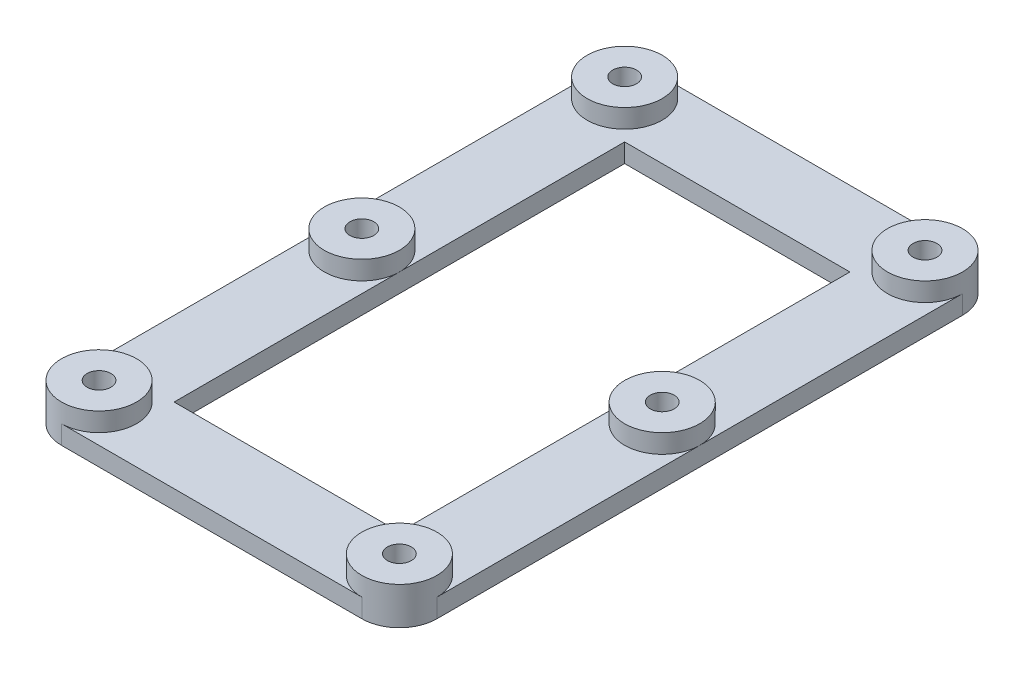
ISO-10303-21;
HEADER;
FILE_DESCRIPTION(('STEP AP214'),'2;1');
FILE_NAME('part.step','',(''),(''),'','','');
FILE_SCHEMA(('AUTOMOTIVE_DESIGN { 1 0 10303 214 1 1 1 1 }'));
ENDSEC;
DATA;
#1=APPLICATION_CONTEXT('core data for automotive mechanical design processes');
#2=APPLICATION_PROTOCOL_DEFINITION('international standard','automotive_design',2000,#1);
#3=PRODUCT_CONTEXT('',#1,'mechanical');
#4=PRODUCT('Part','Part','',(#3));
#5=PRODUCT_RELATED_PRODUCT_CATEGORY('part','',(#4));
#6=PRODUCT_DEFINITION_FORMATION('','',#4);
#7=PRODUCT_DEFINITION_CONTEXT('part definition',#1,'design');
#8=PRODUCT_DEFINITION('design','',#6,#7);
#9=PRODUCT_DEFINITION_SHAPE('','',#8);
#10=(LENGTH_UNIT() NAMED_UNIT(*) SI_UNIT(.MILLI.,.METRE.));
#11=(NAMED_UNIT(*) PLANE_ANGLE_UNIT() SI_UNIT($,.RADIAN.));
#12=(NAMED_UNIT(*) SI_UNIT($,.STERADIAN.) SOLID_ANGLE_UNIT());
#13=UNCERTAINTY_MEASURE_WITH_UNIT(LENGTH_MEASURE(1.E-05),#10,'distance_accuracy_value','');
#14=(GEOMETRIC_REPRESENTATION_CONTEXT(3) GLOBAL_UNCERTAINTY_ASSIGNED_CONTEXT((#13)) GLOBAL_UNIT_ASSIGNED_CONTEXT((#10,
#11,#12)) REPRESENTATION_CONTEXT('',''));
#15=CARTESIAN_POINT('',(0.,0.,0.));
#16=DIRECTION('',(0.,0.,1.));
#17=DIRECTION('',(1.,0.,0.));
#18=AXIS2_PLACEMENT_3D('',#15,#16,#17);
#19=CARTESIAN_POINT('',(31.75,6.35,50.8));
#20=DIRECTION('',(-1.,0.,0.));
#21=DIRECTION('',(0.,0.,1.));
#22=AXIS2_PLACEMENT_3D('',#19,#20,#21);
#23=PLANE('',#22);
#24=DIRECTION('',(0.,0.,-1.));
#25=VECTOR('',#24,1.);
#26=CARTESIAN_POINT('',(31.75,3.175,0.));
#27=LINE('',#26,#25);
#28=CARTESIAN_POINT('',(31.75,3.175,0.));
#29=VERTEX_POINT('',#28);
#30=CARTESIAN_POINT('',(31.75,3.175,-44.45));
#31=VERTEX_POINT('',#30);
#32=EDGE_CURVE('E199',#29,#31,#27,.T.);
#33=ORIENTED_EDGE('',*,*,#32,.F.);
#34=DIRECTION('',(0.,0.,-1.));
#35=VECTOR('',#34,1.);
#36=CARTESIAN_POINT('',(31.75,3.175,0.));
#37=LINE('',#36,#35);
#38=CARTESIAN_POINT('',(31.75,3.175,44.45));
#39=VERTEX_POINT('',#38);
#40=EDGE_CURVE('E209',#39,#29,#37,.T.);
#41=ORIENTED_EDGE('',*,*,#40,.F.);
#42=DIRECTION('',(0.,-1.,0.));
#43=VECTOR('',#42,1.);
#44=CARTESIAN_POINT('',(31.75,6.35,44.45));
#45=LINE('',#44,#43);
#46=CARTESIAN_POINT('',(31.75,0.,44.45));
#47=VERTEX_POINT('',#46);
#48=EDGE_CURVE('E314',#39,#47,#45,.T.);
#49=ORIENTED_EDGE('',*,*,#48,.T.);
#50=DIRECTION('',(0.,0.,-1.));
#51=VECTOR('',#50,1.);
#52=CARTESIAN_POINT('',(31.75,0.,50.8));
#53=LINE('',#52,#51);
#54=CARTESIAN_POINT('',(31.75,0.,-44.45));
#55=VERTEX_POINT('',#54);
#56=EDGE_CURVE('E296',#47,#55,#53,.T.);
#57=ORIENTED_EDGE('',*,*,#56,.T.);
#58=DIRECTION('',(0.,-1.,0.));
#59=VECTOR('',#58,1.);
#60=CARTESIAN_POINT('',(31.75,6.35,-44.45));
#61=LINE('',#60,#59);
#62=EDGE_CURVE('E213',#55,#31,#61,.F.);
#63=ORIENTED_EDGE('',*,*,#62,.T.);
#64=EDGE_LOOP('',(#33,#41,#49,#57,#63));
#65=FACE_BOUND('',#64,.T.);
#66=ADVANCED_FACE('F93',(#65),#23,.F.);
#67=CARTESIAN_POINT('',(0.,6.35,0.));
#68=DIRECTION('',(0.,1.,0.));
#69=DIRECTION('',(0.,0.,1.));
#70=AXIS2_PLACEMENT_3D('',#67,#68,#69);
#71=PLANE('',#70);
#72=CARTESIAN_POINT('',(25.4,6.35,0.));
#73=DIRECTION('',(0.,1.,0.));
#74=DIRECTION('',(0.,0.,1.));
#75=AXIS2_PLACEMENT_3D('',#72,#73,#74);
#76=CIRCLE('',#75,2.0193);
#77=CARTESIAN_POINT('',(25.4,6.35,2.01929999999999));
#78=VERTEX_POINT('',#77);
#79=EDGE_CURVE('E284',#78,#78,#76,.T.);
#80=ORIENTED_EDGE('',*,*,#79,.F.);
#81=EDGE_LOOP('',(#80));
#82=FACE_BOUND('',#81,.T.);
#83=CARTESIAN_POINT('',(25.4,6.35,0.));
#84=DIRECTION('',(0.,1.,0.));
#85=DIRECTION('',(0.,0.,1.));
#86=AXIS2_PLACEMENT_3D('',#83,#84,#85);
#87=CIRCLE('',#86,6.34999999999999);
#88=CARTESIAN_POINT('',(25.4,6.35,6.34999999999998));
#89=VERTEX_POINT('',#88);
#90=EDGE_CURVE('E232',#89,#89,#87,.T.);
#91=ORIENTED_EDGE('',*,*,#90,.T.);
#92=EDGE_LOOP('',(#91));
#93=FACE_BOUND('',#92,.T.);
#94=ADVANCED_FACE('F426',(#82,#93),#71,.T.);
#95=CARTESIAN_POINT('',(-25.4,6.35,0.));
#96=DIRECTION('',(0.,1.,0.));
#97=DIRECTION('',(0.,0.,1.));
#98=AXIS2_PLACEMENT_3D('',#95,#96,#97);
#99=CIRCLE('',#98,2.0193);
#100=CARTESIAN_POINT('',(-25.4,6.35,2.0193));
#101=VERTEX_POINT('',#100);
#102=EDGE_CURVE('E278',#101,#101,#99,.T.);
#103=ORIENTED_EDGE('',*,*,#102,.F.);
#104=EDGE_LOOP('',(#103));
#105=FACE_BOUND('',#104,.T.);
#106=CARTESIAN_POINT('',(-25.4,6.35,0.));
#107=DIRECTION('',(0.,1.,0.));
#108=DIRECTION('',(0.,0.,1.));
#109=AXIS2_PLACEMENT_3D('',#106,#107,#108);
#110=CIRCLE('',#109,6.35);
#111=CARTESIAN_POINT('',(-25.4,6.35,6.35));
#112=VERTEX_POINT('',#111);
#113=EDGE_CURVE('E218',#112,#112,#110,.T.);
#114=ORIENTED_EDGE('',*,*,#113,.T.);
#115=EDGE_LOOP('',(#114));
#116=FACE_BOUND('',#115,.T.);
#117=ADVANCED_FACE('F432',(#105,#116),#71,.T.);
#118=CARTESIAN_POINT('',(-25.4,6.35,-44.45));
#119=DIRECTION('',(0.,1.,0.));
#120=DIRECTION('',(0.,0.,1.));
#121=AXIS2_PLACEMENT_3D('',#118,#119,#120);
#122=CIRCLE('',#121,2.0193);
#123=CARTESIAN_POINT('',(-25.4,6.35,-42.4307));
#124=VERTEX_POINT('',#123);
#125=EDGE_CURVE('E260',#124,#124,#122,.T.);
#126=ORIENTED_EDGE('',*,*,#125,.F.);
#127=EDGE_LOOP('',(#126));
#128=FACE_BOUND('',#127,.T.);
#129=CARTESIAN_POINT('',(-25.4,6.35,-44.45));
#130=DIRECTION('',(0.,1.,0.));
#131=DIRECTION('',(0.,0.,1.));
#132=AXIS2_PLACEMENT_3D('',#129,#130,#131);
#133=CIRCLE('',#132,6.35);
#134=CARTESIAN_POINT('',(-25.4,6.35,-38.1));
#135=VERTEX_POINT('',#134);
#136=EDGE_CURVE('E317',#135,#135,#133,.T.);
#137=ORIENTED_EDGE('',*,*,#136,.T.);
#138=EDGE_LOOP('',(#137));
#139=FACE_BOUND('',#138,.T.);
#140=ADVANCED_FACE('F502',(#128,#139),#71,.T.);
#141=CARTESIAN_POINT('',(25.4,6.35,-44.45));
#142=DIRECTION('',(0.,1.,0.));
#143=DIRECTION('',(0.,0.,1.));
#144=AXIS2_PLACEMENT_3D('',#141,#142,#143);
#145=CIRCLE('',#144,2.0193);
#146=CARTESIAN_POINT('',(25.4,6.35,-42.4307));
#147=VERTEX_POINT('',#146);
#148=EDGE_CURVE('E247',#147,#147,#145,.T.);
#149=ORIENTED_EDGE('',*,*,#148,.F.);
#150=EDGE_LOOP('',(#149));
#151=FACE_BOUND('',#150,.T.);
#152=CARTESIAN_POINT('',(25.4,6.35,-44.45));
#153=DIRECTION('',(0.,1.,0.));
#154=DIRECTION('',(0.,0.,1.));
#155=AXIS2_PLACEMENT_3D('',#152,#153,#154);
#156=CIRCLE('',#155,6.35);
#157=CARTESIAN_POINT('',(25.4,6.35,-38.1));
#158=VERTEX_POINT('',#157);
#159=EDGE_CURVE('E326',#158,#158,#156,.T.);
#160=ORIENTED_EDGE('',*,*,#159,.T.);
#161=EDGE_LOOP('',(#160));
#162=FACE_BOUND('',#161,.T.);
#163=ADVANCED_FACE('F476',(#151,#162),#71,.T.);
#164=CARTESIAN_POINT('',(-19.05,0.,38.1));
#165=DIRECTION('',(-1.,0.,0.));
#166=DIRECTION('',(0.,0.,1.));
#167=AXIS2_PLACEMENT_3D('',#164,#165,#166);
#168=PLANE('',#167);
#169=DIRECTION('',(0.,0.,-1.));
#170=VECTOR('',#169,1.);
#171=CARTESIAN_POINT('',(-19.05,3.175,0.));
#172=LINE('',#171,#170);
#173=CARTESIAN_POINT('',(-19.05,3.175,0.));
#174=VERTEX_POINT('',#173);
#175=CARTESIAN_POINT('',(-19.05,3.175,-38.1));
#176=VERTEX_POINT('',#175);
#177=EDGE_CURVE('E391',#174,#176,#172,.T.);
#178=ORIENTED_EDGE('',*,*,#177,.F.);
#179=DIRECTION('',(0.,0.,-1.));
#180=VECTOR('',#179,1.);
#181=CARTESIAN_POINT('',(-19.05,3.175,0.));
#182=LINE('',#181,#180);
#183=CARTESIAN_POINT('',(-19.05,3.175,38.1));
#184=VERTEX_POINT('',#183);
#185=EDGE_CURVE('E362',#184,#174,#182,.T.);
#186=ORIENTED_EDGE('',*,*,#185,.F.);
#187=DIRECTION('',(0.,1.,0.));
#188=VECTOR('',#187,1.);
#189=CARTESIAN_POINT('',(-19.05,0.,38.1));
#190=LINE('',#189,#188);
#191=CARTESIAN_POINT('',(-19.05,0.,38.1));
#192=VERTEX_POINT('',#191);
#193=EDGE_CURVE('E243',#192,#184,#190,.T.);
#194=ORIENTED_EDGE('',*,*,#193,.F.);
#195=DIRECTION('',(0.,0.,1.));
#196=VECTOR('',#195,1.);
#197=CARTESIAN_POINT('',(-19.05,0.,38.1));
#198=LINE('',#197,#196);
#199=CARTESIAN_POINT('',(-19.05,0.,-38.1));
#200=VERTEX_POINT('',#199);
#201=EDGE_CURVE('E223',#200,#192,#198,.T.);
#202=ORIENTED_EDGE('',*,*,#201,.F.);
#203=DIRECTION('',(0.,1.,0.));
#204=VECTOR('',#203,1.);
#205=CARTESIAN_POINT('',(-19.05,0.,-38.1));
#206=LINE('',#205,#204);
#207=EDGE_CURVE('E244',#200,#176,#206,.T.);
#208=ORIENTED_EDGE('',*,*,#207,.T.);
#209=EDGE_LOOP('',(#178,#186,#194,#202,#208));
#210=FACE_BOUND('',#209,.T.);
#211=ADVANCED_FACE('F402',(#210),#168,.F.);
#212=CARTESIAN_POINT('',(-31.75,6.35,50.8));
#213=DIRECTION('',(1.,0.,0.));
#214=DIRECTION('',(0.,0.,-1.));
#215=AXIS2_PLACEMENT_3D('',#212,#213,#214);
#216=PLANE('',#215);
#217=DIRECTION('',(0.,0.,1.));
#218=VECTOR('',#217,1.);
#219=CARTESIAN_POINT('',(-31.75,3.175,0.));
#220=LINE('',#219,#218);
#221=CARTESIAN_POINT('',(-31.75,3.175,-44.45));
#222=VERTEX_POINT('',#221);
#223=CARTESIAN_POINT('',(-31.75,3.175,0.));
#224=VERTEX_POINT('',#223);
#225=EDGE_CURVE('E341',#222,#224,#220,.T.);
#226=ORIENTED_EDGE('',*,*,#225,.F.);
#227=DIRECTION('',(0.,-1.,0.));
#228=VECTOR('',#227,1.);
#229=CARTESIAN_POINT('',(-31.75,6.35,-44.45));
#230=LINE('',#229,#228);
#231=CARTESIAN_POINT('',(-31.75,0.,-44.45));
#232=VERTEX_POINT('',#231);
#233=EDGE_CURVE('E101',#222,#232,#230,.T.);
#234=ORIENTED_EDGE('',*,*,#233,.T.);
#235=DIRECTION('',(0.,0.,1.));
#236=VECTOR('',#235,1.);
#237=CARTESIAN_POINT('',(-31.75,0.,50.8));
#238=LINE('',#237,#236);
#239=CARTESIAN_POINT('',(-31.75,0.,44.45));
#240=VERTEX_POINT('',#239);
#241=EDGE_CURVE('E290',#232,#240,#238,.T.);
#242=ORIENTED_EDGE('',*,*,#241,.T.);
#243=DIRECTION('',(0.,-1.,0.));
#244=VECTOR('',#243,1.);
#245=CARTESIAN_POINT('',(-31.75,6.35,44.45));
#246=LINE('',#245,#244);
#247=CARTESIAN_POINT('',(-31.75,3.175,44.45));
#248=VERTEX_POINT('',#247);
#249=EDGE_CURVE('E12',#240,#248,#246,.F.);
#250=ORIENTED_EDGE('',*,*,#249,.T.);
#251=DIRECTION('',(0.,0.,1.));
#252=VECTOR('',#251,1.);
#253=CARTESIAN_POINT('',(-31.75,3.175,0.));
#254=LINE('',#253,#252);
#255=EDGE_CURVE('E356',#224,#248,#254,.T.);
#256=ORIENTED_EDGE('',*,*,#255,.F.);
#257=EDGE_LOOP('',(#226,#234,#242,#250,#256));
#258=FACE_BOUND('',#257,.T.);
#259=ADVANCED_FACE('F337',(#258),#216,.F.);
#260=CARTESIAN_POINT('',(31.75,6.35,-50.8));
#261=DIRECTION('',(0.,0.,1.));
#262=DIRECTION('',(1.,0.,0.));
#263=AXIS2_PLACEMENT_3D('',#260,#261,#262);
#264=PLANE('',#263);
#265=DIRECTION('',(-1.,0.,0.));
#266=VECTOR('',#265,1.);
#267=CARTESIAN_POINT('',(0.,3.175,-50.8));
#268=LINE('',#267,#266);
#269=CARTESIAN_POINT('',(25.4,3.175,-50.8));
#270=VERTEX_POINT('',#269);
#271=CARTESIAN_POINT('',(-25.4,3.175,-50.8));
#272=VERTEX_POINT('',#271);
#273=EDGE_CURVE('E381',#270,#272,#268,.T.);
#274=ORIENTED_EDGE('',*,*,#273,.F.);
#275=DIRECTION('',(0.,-1.,0.));
#276=VECTOR('',#275,1.);
#277=CARTESIAN_POINT('',(25.4,6.35,-50.8));
#278=LINE('',#277,#276);
#279=CARTESIAN_POINT('',(25.4,0.,-50.8));
#280=VERTEX_POINT('',#279);
#281=EDGE_CURVE('E304',#270,#280,#278,.T.);
#282=ORIENTED_EDGE('',*,*,#281,.T.);
#283=DIRECTION('',(-1.,0.,0.));
#284=VECTOR('',#283,1.);
#285=CARTESIAN_POINT('',(31.75,0.,-50.8));
#286=LINE('',#285,#284);
#287=CARTESIAN_POINT('',(-25.4,0.,-50.8));
#288=VERTEX_POINT('',#287);
#289=EDGE_CURVE('E298',#280,#288,#286,.T.);
#290=ORIENTED_EDGE('',*,*,#289,.T.);
#291=DIRECTION('',(0.,-1.,0.));
#292=VECTOR('',#291,1.);
#293=CARTESIAN_POINT('',(-25.4,6.35,-50.8));
#294=LINE('',#293,#292);
#295=EDGE_CURVE('E301',#288,#272,#294,.F.);
#296=ORIENTED_EDGE('',*,*,#295,.T.);
#297=EDGE_LOOP('',(#274,#282,#290,#296));
#298=FACE_BOUND('',#297,.T.);
#299=ADVANCED_FACE('F422',(#298),#264,.F.);
#300=CARTESIAN_POINT('',(19.05,0.,-38.1));
#301=DIRECTION('',(0.,0.,-1.));
#302=DIRECTION('',(-1.,0.,0.));
#303=AXIS2_PLACEMENT_3D('',#300,#301,#302);
#304=PLANE('',#303);
#305=DIRECTION('',(1.,0.,0.));
#306=VECTOR('',#305,1.);
#307=CARTESIAN_POINT('',(0.,3.175,-38.1));
#308=LINE('',#307,#306);
#309=CARTESIAN_POINT('',(19.05,3.175,-38.1));
#310=VERTEX_POINT('',#309);
#311=EDGE_CURVE('E393',#176,#310,#308,.T.);
#312=ORIENTED_EDGE('',*,*,#311,.F.);
#313=ORIENTED_EDGE('',*,*,#207,.F.);
#314=DIRECTION('',(-1.,0.,0.));
#315=VECTOR('',#314,1.);
#316=CARTESIAN_POINT('',(19.05,0.,-38.1));
#317=LINE('',#316,#315);
#318=CARTESIAN_POINT('',(19.05,0.,-38.1));
#319=VERTEX_POINT('',#318);
#320=EDGE_CURVE('E240',#319,#200,#317,.T.);
#321=ORIENTED_EDGE('',*,*,#320,.F.);
#322=DIRECTION('',(0.,1.,0.));
#323=VECTOR('',#322,1.);
#324=CARTESIAN_POINT('',(19.05,0.,-38.1));
#325=LINE('',#324,#323);
#326=EDGE_CURVE('E248',#319,#310,#325,.T.);
#327=ORIENTED_EDGE('',*,*,#326,.T.);
#328=EDGE_LOOP('',(#312,#313,#321,#327));
#329=FACE_BOUND('',#328,.T.);
#330=ADVANCED_FACE('F412',(#329),#304,.F.);
#331=CARTESIAN_POINT('',(19.05,0.,38.1));
#332=DIRECTION('',(1.,0.,0.));
#333=DIRECTION('',(0.,0.,-1.));
#334=AXIS2_PLACEMENT_3D('',#331,#332,#333);
#335=PLANE('',#334);
#336=DIRECTION('',(0.,0.,1.));
#337=VECTOR('',#336,1.);
#338=CARTESIAN_POINT('',(19.05,3.175,0.));
#339=LINE('',#338,#337);
#340=CARTESIAN_POINT('',(19.05,3.175,0.));
#341=VERTEX_POINT('',#340);
#342=EDGE_CURVE('E202',#310,#341,#339,.T.);
#343=ORIENTED_EDGE('',*,*,#342,.F.);
#344=ORIENTED_EDGE('',*,*,#326,.F.);
#345=DIRECTION('',(0.,0.,-1.));
#346=VECTOR('',#345,1.);
#347=CARTESIAN_POINT('',(19.05,0.,38.1));
#348=LINE('',#347,#346);
#349=CARTESIAN_POINT('',(19.05,0.,38.1));
#350=VERTEX_POINT('',#349);
#351=EDGE_CURVE('E116',#350,#319,#348,.T.);
#352=ORIENTED_EDGE('',*,*,#351,.F.);
#353=DIRECTION('',(0.,1.,0.));
#354=VECTOR('',#353,1.);
#355=CARTESIAN_POINT('',(19.05,0.,38.1));
#356=LINE('',#355,#354);
#357=CARTESIAN_POINT('',(19.05,3.175,38.1));
#358=VERTEX_POINT('',#357);
#359=EDGE_CURVE('E251',#350,#358,#356,.T.);
#360=ORIENTED_EDGE('',*,*,#359,.T.);
#361=DIRECTION('',(0.,0.,1.));
#362=VECTOR('',#361,1.);
#363=CARTESIAN_POINT('',(19.05,3.175,0.));
#364=LINE('',#363,#362);
#365=EDGE_CURVE('E108',#341,#358,#364,.T.);
#366=ORIENTED_EDGE('',*,*,#365,.F.);
#367=EDGE_LOOP('',(#343,#344,#352,#360,#366));
#368=FACE_BOUND('',#367,.T.);
#369=ADVANCED_FACE('F413',(#368),#335,.F.);
#370=CARTESIAN_POINT('',(31.75,6.35,50.8));
#371=DIRECTION('',(0.,0.,-1.));
#372=DIRECTION('',(-1.,0.,0.));
#373=AXIS2_PLACEMENT_3D('',#370,#371,#372);
#374=PLANE('',#373);
#375=DIRECTION('',(1.,0.,0.));
#376=VECTOR('',#375,1.);
#377=CARTESIAN_POINT('',(0.,3.175,50.8));
#378=LINE('',#377,#376);
#379=CARTESIAN_POINT('',(-25.4,3.175,50.8));
#380=VERTEX_POINT('',#379);
#381=CARTESIAN_POINT('',(25.4,3.175,50.8));
#382=VERTEX_POINT('',#381);
#383=EDGE_CURVE('E228',#380,#382,#378,.T.);
#384=ORIENTED_EDGE('',*,*,#383,.F.);
#385=DIRECTION('',(0.,-1.,0.));
#386=VECTOR('',#385,1.);
#387=CARTESIAN_POINT('',(-25.4,6.35,50.8));
#388=LINE('',#387,#386);
#389=CARTESIAN_POINT('',(-25.4,0.,50.8));
#390=VERTEX_POINT('',#389);
#391=EDGE_CURVE('E329',#380,#390,#388,.T.);
#392=ORIENTED_EDGE('',*,*,#391,.T.);
#393=DIRECTION('',(1.,0.,0.));
#394=VECTOR('',#393,1.);
#395=CARTESIAN_POINT('',(31.75,0.,50.8));
#396=LINE('',#395,#394);
#397=CARTESIAN_POINT('',(25.4,0.,50.8));
#398=VERTEX_POINT('',#397);
#399=EDGE_CURVE('E293',#390,#398,#396,.T.);
#400=ORIENTED_EDGE('',*,*,#399,.T.);
#401=DIRECTION('',(0.,-1.,0.));
#402=VECTOR('',#401,1.);
#403=CARTESIAN_POINT('',(25.4,6.35,50.8));
#404=LINE('',#403,#402);
#405=EDGE_CURVE('E331',#398,#382,#404,.F.);
#406=ORIENTED_EDGE('',*,*,#405,.T.);
#407=EDGE_LOOP('',(#384,#392,#400,#406));
#408=FACE_BOUND('',#407,.T.);
#409=ADVANCED_FACE('F368',(#408),#374,.F.);
#410=CARTESIAN_POINT('',(25.4,6.35,44.45));
#411=DIRECTION('',(0.,1.,0.));
#412=DIRECTION('',(0.,0.,1.));
#413=AXIS2_PLACEMENT_3D('',#410,#411,#412);
#414=CIRCLE('',#413,2.0193);
#415=CARTESIAN_POINT('',(25.4,6.35,46.4693));
#416=VERTEX_POINT('',#415);
#417=EDGE_CURVE('E272',#416,#416,#414,.T.);
#418=ORIENTED_EDGE('',*,*,#417,.F.);
#419=EDGE_LOOP('',(#418));
#420=FACE_BOUND('',#419,.T.);
#421=CARTESIAN_POINT('',(25.4,6.35,44.45));
#422=DIRECTION('',(0.,1.,0.));
#423=DIRECTION('',(0.,0.,1.));
#424=AXIS2_PLACEMENT_3D('',#421,#422,#423);
#425=CIRCLE('',#424,6.35);
#426=CARTESIAN_POINT('',(25.4,6.35,50.8));
#427=VERTEX_POINT('',#426);
#428=EDGE_CURVE('E323',#427,#427,#425,.T.);
#429=ORIENTED_EDGE('',*,*,#428,.T.);
#430=EDGE_LOOP('',(#429));
#431=FACE_BOUND('',#430,.T.);
#432=ADVANCED_FACE('F420',(#420,#431),#71,.T.);
#433=CARTESIAN_POINT('',(-25.4,6.35,44.45));
#434=DIRECTION('',(0.,1.,0.));
#435=DIRECTION('',(0.,0.,1.));
#436=AXIS2_PLACEMENT_3D('',#433,#434,#435);
#437=CIRCLE('',#436,2.0193);
#438=CARTESIAN_POINT('',(-25.4,6.35,46.4693));
#439=VERTEX_POINT('',#438);
#440=EDGE_CURVE('E266',#439,#439,#437,.T.);
#441=ORIENTED_EDGE('',*,*,#440,.F.);
#442=EDGE_LOOP('',(#441));
#443=FACE_BOUND('',#442,.T.);
#444=CARTESIAN_POINT('',(-25.4,6.35,44.45));
#445=DIRECTION('',(0.,1.,0.));
#446=DIRECTION('',(0.,0.,1.));
#447=AXIS2_PLACEMENT_3D('',#444,#445,#446);
#448=CIRCLE('',#447,6.35);
#449=CARTESIAN_POINT('',(-25.4,6.35,50.8));
#450=VERTEX_POINT('',#449);
#451=EDGE_CURVE('E320',#450,#450,#448,.T.);
#452=ORIENTED_EDGE('',*,*,#451,.T.);
#453=EDGE_LOOP('',(#452));
#454=FACE_BOUND('',#453,.T.);
#455=ADVANCED_FACE('F435',(#443,#454),#71,.T.);
#456=CARTESIAN_POINT('',(19.05,0.,38.1));
#457=DIRECTION('',(0.,0.,1.));
#458=DIRECTION('',(1.,0.,0.));
#459=AXIS2_PLACEMENT_3D('',#456,#457,#458);
#460=PLANE('',#459);
#461=DIRECTION('',(-1.,0.,0.));
#462=VECTOR('',#461,1.);
#463=CARTESIAN_POINT('',(0.,3.175,38.1));
#464=LINE('',#463,#462);
#465=EDGE_CURVE('E397',#358,#184,#464,.T.);
#466=ORIENTED_EDGE('',*,*,#465,.F.);
#467=ORIENTED_EDGE('',*,*,#359,.F.);
#468=DIRECTION('',(1.,0.,0.));
#469=VECTOR('',#468,1.);
#470=CARTESIAN_POINT('',(19.05,0.,38.1));
#471=LINE('',#470,#469);
#472=EDGE_CURVE('E226',#192,#350,#471,.T.);
#473=ORIENTED_EDGE('',*,*,#472,.F.);
#474=ORIENTED_EDGE('',*,*,#193,.T.);
#475=EDGE_LOOP('',(#466,#467,#473,#474));
#476=FACE_BOUND('',#475,.T.);
#477=ADVANCED_FACE('F406',(#476),#460,.F.);
#478=CARTESIAN_POINT('',(0.,0.,0.));
#479=DIRECTION('',(0.,1.,0.));
#480=DIRECTION('',(0.,0.,1.));
#481=AXIS2_PLACEMENT_3D('',#478,#479,#480);
#482=PLANE('',#481);
#483=ORIENTED_EDGE('',*,*,#320,.T.);
#484=ORIENTED_EDGE('',*,*,#201,.T.);
#485=ORIENTED_EDGE('',*,*,#472,.T.);
#486=ORIENTED_EDGE('',*,*,#351,.T.);
#487=EDGE_LOOP('',(#483,#484,#485,#486));
#488=FACE_BOUND('',#487,.T.);
#489=CARTESIAN_POINT('',(25.4,0.,-44.45));
#490=DIRECTION('',(0.,1.,0.));
#491=DIRECTION('',(0.,0.,1.));
#492=AXIS2_PLACEMENT_3D('',#489,#490,#491);
#493=CIRCLE('',#492,2.0193);
#494=CARTESIAN_POINT('',(25.4,0.,-42.4307));
#495=VERTEX_POINT('',#494);
#496=EDGE_CURVE('E257',#495,#495,#493,.T.);
#497=ORIENTED_EDGE('',*,*,#496,.T.);
#498=EDGE_LOOP('',(#497));
#499=FACE_BOUND('',#498,.T.);
#500=CARTESIAN_POINT('',(-25.4,0.,-44.45));
#501=DIRECTION('',(0.,1.,0.));
#502=DIRECTION('',(0.,0.,1.));
#503=AXIS2_PLACEMENT_3D('',#500,#501,#502);
#504=CIRCLE('',#503,2.0193);
#505=CARTESIAN_POINT('',(-25.4,0.,-42.4307));
#506=VERTEX_POINT('',#505);
#507=EDGE_CURVE('E263',#506,#506,#504,.T.);
#508=ORIENTED_EDGE('',*,*,#507,.T.);
#509=EDGE_LOOP('',(#508));
#510=FACE_BOUND('',#509,.T.);
#511=CARTESIAN_POINT('',(-25.4,0.,44.45));
#512=DIRECTION('',(0.,1.,0.));
#513=DIRECTION('',(0.,0.,1.));
#514=AXIS2_PLACEMENT_3D('',#511,#512,#513);
#515=CIRCLE('',#514,2.0193);
#516=CARTESIAN_POINT('',(-25.4,0.,46.4693));
#517=VERTEX_POINT('',#516);
#518=EDGE_CURVE('E269',#517,#517,#515,.T.);
#519=ORIENTED_EDGE('',*,*,#518,.T.);
#520=EDGE_LOOP('',(#519));
#521=FACE_BOUND('',#520,.T.);
#522=CARTESIAN_POINT('',(25.4,0.,44.45));
#523=DIRECTION('',(0.,1.,0.));
#524=DIRECTION('',(0.,0.,1.));
#525=AXIS2_PLACEMENT_3D('',#522,#523,#524);
#526=CIRCLE('',#525,2.0193);
#527=CARTESIAN_POINT('',(25.4,0.,46.4693));
#528=VERTEX_POINT('',#527);
#529=EDGE_CURVE('E275',#528,#528,#526,.T.);
#530=ORIENTED_EDGE('',*,*,#529,.T.);
#531=EDGE_LOOP('',(#530));
#532=FACE_BOUND('',#531,.T.);
#533=CARTESIAN_POINT('',(-25.4,0.,0.));
#534=DIRECTION('',(0.,1.,0.));
#535=DIRECTION('',(0.,0.,1.));
#536=AXIS2_PLACEMENT_3D('',#533,#534,#535);
#537=CIRCLE('',#536,2.0193);
#538=CARTESIAN_POINT('',(-25.4,0.,2.0193));
#539=VERTEX_POINT('',#538);
#540=EDGE_CURVE('E281',#539,#539,#537,.T.);
#541=ORIENTED_EDGE('',*,*,#540,.T.);
#542=EDGE_LOOP('',(#541));
#543=FACE_BOUND('',#542,.T.);
#544=CARTESIAN_POINT('',(25.4,0.,0.));
#545=DIRECTION('',(0.,1.,0.));
#546=DIRECTION('',(0.,0.,1.));
#547=AXIS2_PLACEMENT_3D('',#544,#545,#546);
#548=CIRCLE('',#547,2.0193);
#549=CARTESIAN_POINT('',(25.4,0.,2.01929999999999));
#550=VERTEX_POINT('',#549);
#551=EDGE_CURVE('E287',#550,#550,#548,.T.);
#552=ORIENTED_EDGE('',*,*,#551,.T.);
#553=EDGE_LOOP('',(#552));
#554=FACE_BOUND('',#553,.T.);
#555=ORIENTED_EDGE('',*,*,#289,.F.);
#556=CARTESIAN_POINT('',(25.4,0.,-44.45));
#557=DIRECTION('',(0.,1.,0.));
#558=DIRECTION('',(0.,0.,1.));
#559=AXIS2_PLACEMENT_3D('',#556,#557,#558);
#560=CIRCLE('',#559,6.35);
#561=EDGE_CURVE('E312',#280,#55,#560,.F.);
#562=ORIENTED_EDGE('',*,*,#561,.T.);
#563=ORIENTED_EDGE('',*,*,#56,.F.);
#564=CARTESIAN_POINT('',(25.4,0.,44.45));
#565=DIRECTION('',(0.,1.,0.));
#566=DIRECTION('',(0.,0.,1.));
#567=AXIS2_PLACEMENT_3D('',#564,#565,#566);
#568=CIRCLE('',#567,6.35);
#569=EDGE_CURVE('E310',#47,#398,#568,.F.);
#570=ORIENTED_EDGE('',*,*,#569,.T.);
#571=ORIENTED_EDGE('',*,*,#399,.F.);
#572=CARTESIAN_POINT('',(-25.4,0.,44.45));
#573=DIRECTION('',(0.,1.,0.));
#574=DIRECTION('',(0.,0.,1.));
#575=AXIS2_PLACEMENT_3D('',#572,#573,#574);
#576=CIRCLE('',#575,6.35);
#577=EDGE_CURVE('E308',#390,#240,#576,.F.);
#578=ORIENTED_EDGE('',*,*,#577,.T.);
#579=ORIENTED_EDGE('',*,*,#241,.F.);
#580=CARTESIAN_POINT('',(-25.4,0.,-44.45));
#581=DIRECTION('',(0.,1.,0.));
#582=DIRECTION('',(0.,0.,1.));
#583=AXIS2_PLACEMENT_3D('',#580,#581,#582);
#584=CIRCLE('',#583,6.35);
#585=EDGE_CURVE('E306',#232,#288,#584,.F.);
#586=ORIENTED_EDGE('',*,*,#585,.T.);
#587=EDGE_LOOP('',(#555,#562,#563,#570,#571,#578,#579,#586));
#588=FACE_BOUND('',#587,.T.);
#589=ADVANCED_FACE('F347',(#488,#499,#510,#521,#532,#543,#554,#588),#482,.F.);
#590=CARTESIAN_POINT('',(25.4,6.35,-44.45));
#591=DIRECTION('',(0.,-1.,0.));
#592=DIRECTION('',(0.,0.,-1.));
#593=AXIS2_PLACEMENT_3D('',#590,#591,#592);
#594=CYLINDRICAL_SURFACE('',#593,6.35);
#595=ORIENTED_EDGE('',*,*,#281,.F.);
#596=CARTESIAN_POINT('',(25.4,3.175,-44.45));
#597=DIRECTION('',(0.,1.,0.));
#598=DIRECTION('',(0.,0.,1.));
#599=AXIS2_PLACEMENT_3D('',#596,#597,#598);
#600=CIRCLE('',#599,6.35);
#601=EDGE_CURVE('E214',#270,#31,#600,.T.);
#602=ORIENTED_EDGE('',*,*,#601,.T.);
#603=ORIENTED_EDGE('',*,*,#62,.F.);
#604=ORIENTED_EDGE('',*,*,#561,.F.);
#605=EDGE_LOOP('',(#595,#602,#603,#604));
#606=FACE_BOUND('',#605,.T.);
#607=ORIENTED_EDGE('',*,*,#159,.F.);
#608=EDGE_LOOP('',(#607));
#609=FACE_BOUND('',#608,.T.);
#610=ADVANCED_FACE('F377',(#606,#609),#594,.T.);
#611=CARTESIAN_POINT('',(25.4,6.35,44.45));
#612=DIRECTION('',(0.,-1.,0.));
#613=DIRECTION('',(0.,0.,-1.));
#614=AXIS2_PLACEMENT_3D('',#611,#612,#613);
#615=CYLINDRICAL_SURFACE('',#614,6.35);
#616=ORIENTED_EDGE('',*,*,#48,.F.);
#617=CARTESIAN_POINT('',(25.4,3.175,44.45));
#618=DIRECTION('',(0.,1.,0.));
#619=DIRECTION('',(0.,0.,1.));
#620=AXIS2_PLACEMENT_3D('',#617,#618,#619);
#621=CIRCLE('',#620,6.35);
#622=EDGE_CURVE('E222',#39,#382,#621,.T.);
#623=ORIENTED_EDGE('',*,*,#622,.T.);
#624=ORIENTED_EDGE('',*,*,#405,.F.);
#625=ORIENTED_EDGE('',*,*,#569,.F.);
#626=EDGE_LOOP('',(#616,#623,#624,#625));
#627=FACE_BOUND('',#626,.T.);
#628=ORIENTED_EDGE('',*,*,#428,.F.);
#629=EDGE_LOOP('',(#628));
#630=FACE_BOUND('',#629,.T.);
#631=ADVANCED_FACE('F371',(#627,#630),#615,.T.);
#632=CARTESIAN_POINT('',(-25.4,6.35,44.45));
#633=DIRECTION('',(0.,-1.,0.));
#634=DIRECTION('',(0.,0.,-1.));
#635=AXIS2_PLACEMENT_3D('',#632,#633,#634);
#636=CYLINDRICAL_SURFACE('',#635,6.35);
#637=ORIENTED_EDGE('',*,*,#391,.F.);
#638=CARTESIAN_POINT('',(-25.4,3.175,44.45));
#639=DIRECTION('',(0.,1.,0.));
#640=DIRECTION('',(0.,0.,1.));
#641=AXIS2_PLACEMENT_3D('',#638,#639,#640);
#642=CIRCLE('',#641,6.35);
#643=EDGE_CURVE('E354',#380,#248,#642,.T.);
#644=ORIENTED_EDGE('',*,*,#643,.T.);
#645=ORIENTED_EDGE('',*,*,#249,.F.);
#646=ORIENTED_EDGE('',*,*,#577,.F.);
#647=EDGE_LOOP('',(#637,#644,#645,#646));
#648=FACE_BOUND('',#647,.T.);
#649=ORIENTED_EDGE('',*,*,#451,.F.);
#650=EDGE_LOOP('',(#649));
#651=FACE_BOUND('',#650,.T.);
#652=ADVANCED_FACE('F352',(#648,#651),#636,.T.);
#653=CARTESIAN_POINT('',(-25.4,6.35,-44.45));
#654=DIRECTION('',(0.,-1.,0.));
#655=DIRECTION('',(0.,0.,-1.));
#656=AXIS2_PLACEMENT_3D('',#653,#654,#655);
#657=CYLINDRICAL_SURFACE('',#656,6.35);
#658=ORIENTED_EDGE('',*,*,#233,.F.);
#659=CARTESIAN_POINT('',(-25.4,3.175,-44.45));
#660=DIRECTION('',(0.,1.,0.));
#661=DIRECTION('',(0.,0.,1.));
#662=AXIS2_PLACEMENT_3D('',#659,#660,#661);
#663=CIRCLE('',#662,6.35000000000001);
#664=EDGE_CURVE('E383',#222,#272,#663,.T.);
#665=ORIENTED_EDGE('',*,*,#664,.T.);
#666=ORIENTED_EDGE('',*,*,#295,.F.);
#667=ORIENTED_EDGE('',*,*,#585,.F.);
#668=EDGE_LOOP('',(#658,#665,#666,#667));
#669=FACE_BOUND('',#668,.T.);
#670=ORIENTED_EDGE('',*,*,#136,.F.);
#671=EDGE_LOOP('',(#670));
#672=FACE_BOUND('',#671,.T.);
#673=ADVANCED_FACE('F95',(#669,#672),#657,.T.);
#674=CARTESIAN_POINT('',(25.4,6.35,0.));
#675=DIRECTION('',(0.,1.,0.));
#676=DIRECTION('',(0.,0.,1.));
#677=AXIS2_PLACEMENT_3D('',#674,#675,#676);
#678=CYLINDRICAL_SURFACE('',#677,2.0193);
#679=ORIENTED_EDGE('',*,*,#551,.F.);
#680=EDGE_LOOP('',(#679));
#681=FACE_BOUND('',#680,.T.);
#682=ORIENTED_EDGE('',*,*,#79,.T.);
#683=EDGE_LOOP('',(#682));
#684=FACE_BOUND('',#683,.T.);
#685=ADVANCED_FACE('F448',(#681,#684),#678,.F.);
#686=CARTESIAN_POINT('',(-25.4,6.35,0.));
#687=DIRECTION('',(0.,1.,0.));
#688=DIRECTION('',(0.,0.,1.));
#689=AXIS2_PLACEMENT_3D('',#686,#687,#688);
#690=CYLINDRICAL_SURFACE('',#689,2.0193);
#691=ORIENTED_EDGE('',*,*,#540,.F.);
#692=EDGE_LOOP('',(#691));
#693=FACE_BOUND('',#692,.T.);
#694=ORIENTED_EDGE('',*,*,#102,.T.);
#695=EDGE_LOOP('',(#694));
#696=FACE_BOUND('',#695,.T.);
#697=ADVANCED_FACE('F453',(#693,#696),#690,.F.);
#698=CARTESIAN_POINT('',(25.4,6.35,44.45));
#699=DIRECTION('',(0.,1.,0.));
#700=DIRECTION('',(0.,0.,1.));
#701=AXIS2_PLACEMENT_3D('',#698,#699,#700);
#702=CYLINDRICAL_SURFACE('',#701,2.0193);
#703=ORIENTED_EDGE('',*,*,#529,.F.);
#704=EDGE_LOOP('',(#703));
#705=FACE_BOUND('',#704,.T.);
#706=ORIENTED_EDGE('',*,*,#417,.T.);
#707=EDGE_LOOP('',(#706));
#708=FACE_BOUND('',#707,.T.);
#709=ADVANCED_FACE('F460',(#705,#708),#702,.F.);
#710=CARTESIAN_POINT('',(-25.4,6.35,44.45));
#711=DIRECTION('',(0.,1.,0.));
#712=DIRECTION('',(0.,0.,1.));
#713=AXIS2_PLACEMENT_3D('',#710,#711,#712);
#714=CYLINDRICAL_SURFACE('',#713,2.0193);
#715=ORIENTED_EDGE('',*,*,#518,.F.);
#716=EDGE_LOOP('',(#715));
#717=FACE_BOUND('',#716,.T.);
#718=ORIENTED_EDGE('',*,*,#440,.T.);
#719=EDGE_LOOP('',(#718));
#720=FACE_BOUND('',#719,.T.);
#721=ADVANCED_FACE('F484',(#717,#720),#714,.F.);
#722=CARTESIAN_POINT('',(-25.4,6.35,-44.45));
#723=DIRECTION('',(0.,1.,0.));
#724=DIRECTION('',(0.,0.,1.));
#725=AXIS2_PLACEMENT_3D('',#722,#723,#724);
#726=CYLINDRICAL_SURFACE('',#725,2.0193);
#727=ORIENTED_EDGE('',*,*,#507,.F.);
#728=EDGE_LOOP('',(#727));
#729=FACE_BOUND('',#728,.T.);
#730=ORIENTED_EDGE('',*,*,#125,.T.);
#731=EDGE_LOOP('',(#730));
#732=FACE_BOUND('',#731,.T.);
#733=ADVANCED_FACE('F480',(#729,#732),#726,.F.);
#734=CARTESIAN_POINT('',(25.4,6.35,-44.45));
#735=DIRECTION('',(0.,1.,0.));
#736=DIRECTION('',(0.,0.,1.));
#737=AXIS2_PLACEMENT_3D('',#734,#735,#736);
#738=CYLINDRICAL_SURFACE('',#737,2.0193);
#739=ORIENTED_EDGE('',*,*,#496,.F.);
#740=EDGE_LOOP('',(#739));
#741=FACE_BOUND('',#740,.T.);
#742=ORIENTED_EDGE('',*,*,#148,.T.);
#743=EDGE_LOOP('',(#742));
#744=FACE_BOUND('',#743,.T.);
#745=ADVANCED_FACE('F477',(#741,#744),#738,.F.);
#746=CARTESIAN_POINT('',(25.4,3.175,0.));
#747=DIRECTION('',(0.,1.,0.));
#748=DIRECTION('',(0.,0.,1.));
#749=AXIS2_PLACEMENT_3D('',#746,#747,#748);
#750=CYLINDRICAL_SURFACE('',#749,6.34999999999999);
#751=ORIENTED_EDGE('',*,*,#90,.F.);
#752=EDGE_LOOP('',(#751));
#753=FACE_BOUND('',#752,.T.);
#754=CARTESIAN_POINT('',(25.4,3.175,0.));
#755=DIRECTION('',(0.,1.,0.));
#756=DIRECTION('',(0.,0.,1.));
#757=AXIS2_PLACEMENT_3D('',#754,#755,#756);
#758=CIRCLE('',#757,6.34999999999999);
#759=EDGE_CURVE('E196',#29,#341,#758,.T.);
#760=ORIENTED_EDGE('',*,*,#759,.T.);
#761=CARTESIAN_POINT('',(25.4,3.175,0.));
#762=DIRECTION('',(0.,1.,0.));
#763=DIRECTION('',(0.,0.,1.));
#764=AXIS2_PLACEMENT_3D('',#761,#762,#763);
#765=CIRCLE('',#764,6.34999999999999);
#766=EDGE_CURVE('E216',#341,#29,#765,.T.);
#767=ORIENTED_EDGE('',*,*,#766,.T.);
#768=EDGE_LOOP('',(#760,#767));
#769=FACE_BOUND('',#768,.T.);
#770=ADVANCED_FACE('F217',(#753,#769),#750,.T.);
#771=CARTESIAN_POINT('',(-25.4,3.175,0.));
#772=DIRECTION('',(0.,1.,0.));
#773=DIRECTION('',(0.,0.,1.));
#774=AXIS2_PLACEMENT_3D('',#771,#772,#773);
#775=CYLINDRICAL_SURFACE('',#774,6.35);
#776=ORIENTED_EDGE('',*,*,#113,.F.);
#777=EDGE_LOOP('',(#776));
#778=FACE_BOUND('',#777,.T.);
#779=CARTESIAN_POINT('',(-25.4,3.175,0.));
#780=DIRECTION('',(0.,1.,0.));
#781=DIRECTION('',(0.,0.,1.));
#782=AXIS2_PLACEMENT_3D('',#779,#780,#781);
#783=CIRCLE('',#782,6.35);
#784=EDGE_CURVE('E358',#224,#174,#783,.T.);
#785=ORIENTED_EDGE('',*,*,#784,.T.);
#786=CARTESIAN_POINT('',(-25.4,3.175,0.));
#787=DIRECTION('',(0.,1.,0.));
#788=DIRECTION('',(0.,0.,1.));
#789=AXIS2_PLACEMENT_3D('',#786,#787,#788);
#790=CIRCLE('',#789,6.35);
#791=EDGE_CURVE('E388',#174,#224,#790,.T.);
#792=ORIENTED_EDGE('',*,*,#791,.T.);
#793=EDGE_LOOP('',(#785,#792));
#794=FACE_BOUND('',#793,.T.);
#795=ADVANCED_FACE('F526',(#778,#794),#775,.T.);
#796=CARTESIAN_POINT('',(0.,3.175,0.));
#797=DIRECTION('',(0.,1.,0.));
#798=DIRECTION('',(0.,0.,1.));
#799=AXIS2_PLACEMENT_3D('',#796,#797,#798);
#800=PLANE('',#799);
#801=ORIENTED_EDGE('',*,*,#766,.F.);
#802=ORIENTED_EDGE('',*,*,#365,.T.);
#803=ORIENTED_EDGE('',*,*,#465,.T.);
#804=ORIENTED_EDGE('',*,*,#185,.T.);
#805=ORIENTED_EDGE('',*,*,#784,.F.);
#806=ORIENTED_EDGE('',*,*,#255,.T.);
#807=ORIENTED_EDGE('',*,*,#643,.F.);
#808=ORIENTED_EDGE('',*,*,#383,.T.);
#809=ORIENTED_EDGE('',*,*,#622,.F.);
#810=ORIENTED_EDGE('',*,*,#40,.T.);
#811=EDGE_LOOP('',(#801,#802,#803,#804,#805,#806,#807,#808,#809,#810));
#812=FACE_BOUND('',#811,.T.);
#813=ADVANCED_FACE('F220',(#812),#800,.T.);
#814=CARTESIAN_POINT('',(0.,3.175,0.));
#815=DIRECTION('',(0.,1.,0.));
#816=DIRECTION('',(0.,0.,1.));
#817=AXIS2_PLACEMENT_3D('',#814,#815,#816);
#818=PLANE('',#817);
#819=ORIENTED_EDGE('',*,*,#759,.F.);
#820=ORIENTED_EDGE('',*,*,#32,.T.);
#821=ORIENTED_EDGE('',*,*,#601,.F.);
#822=ORIENTED_EDGE('',*,*,#273,.T.);
#823=ORIENTED_EDGE('',*,*,#664,.F.);
#824=ORIENTED_EDGE('',*,*,#225,.T.);
#825=ORIENTED_EDGE('',*,*,#791,.F.);
#826=ORIENTED_EDGE('',*,*,#177,.T.);
#827=ORIENTED_EDGE('',*,*,#311,.T.);
#828=ORIENTED_EDGE('',*,*,#342,.T.);
#829=EDGE_LOOP('',(#819,#820,#821,#822,#823,#824,#825,#826,#827,#828));
#830=FACE_BOUND('',#829,.T.);
#831=ADVANCED_FACE('F198',(#830),#818,.T.);
#832=CLOSED_SHELL('',(#66,#94,#117,#140,#163,#211,#259,#299,#330,#369,#409,#432,#455,#477,#589,
#610,#631,#652,#673,#685,#697,#709,#721,#733,#745,#770,#795,#813,#831));
#833=MANIFOLD_SOLID_BREP('B2',#832);
#834=ADVANCED_BREP_SHAPE_REPRESENTATION('',(#18,#833),#14);
#835=SHAPE_DEFINITION_REPRESENTATION(#9,#834);
ENDSEC;
END-ISO-10303-21;
